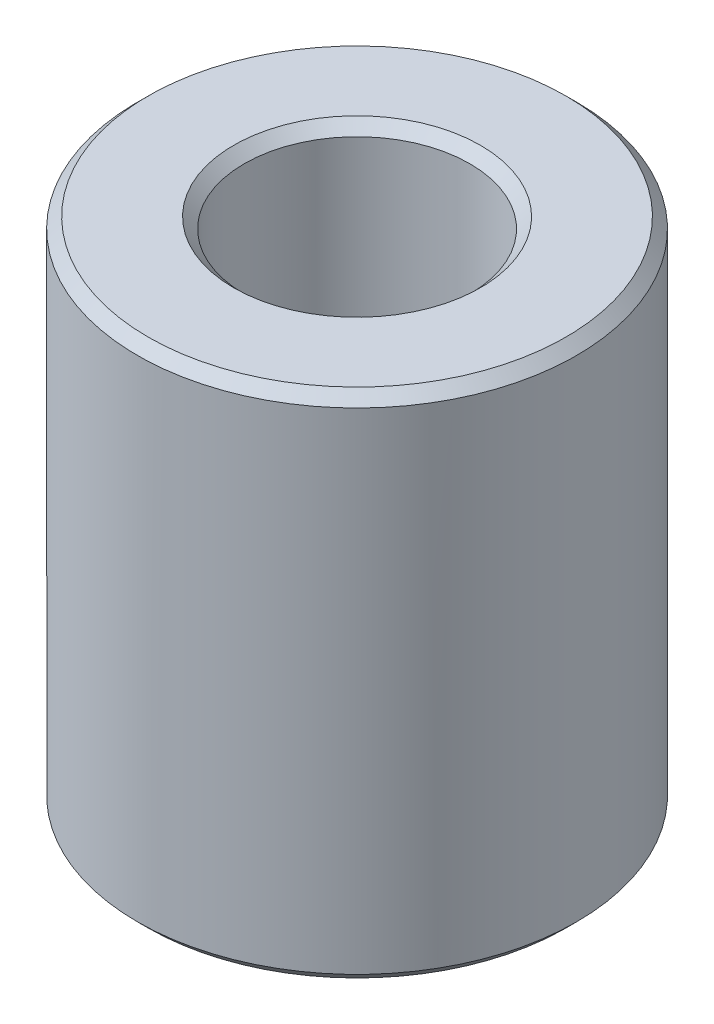
ISO-10303-21;
HEADER;
FILE_DESCRIPTION(('STEP AP214'),'2;1');
FILE_NAME('part.step','',(''),(''),'','','');
FILE_SCHEMA(('AUTOMOTIVE_DESIGN { 1 0 10303 214 1 1 1 1 }'));
ENDSEC;
DATA;
#1=APPLICATION_CONTEXT('core data for automotive mechanical design processes');
#2=APPLICATION_PROTOCOL_DEFINITION('international standard','automotive_design',2000,#1);
#3=PRODUCT_CONTEXT('',#1,'mechanical');
#4=PRODUCT('Part','Part','',(#3));
#5=PRODUCT_RELATED_PRODUCT_CATEGORY('part','',(#4));
#6=PRODUCT_DEFINITION_FORMATION('','',#4);
#7=PRODUCT_DEFINITION_CONTEXT('part definition',#1,'design');
#8=PRODUCT_DEFINITION('design','',#6,#7);
#9=PRODUCT_DEFINITION_SHAPE('','',#8);
#10=(LENGTH_UNIT() NAMED_UNIT(*) SI_UNIT(.MILLI.,.METRE.));
#11=(NAMED_UNIT(*) PLANE_ANGLE_UNIT() SI_UNIT($,.RADIAN.));
#12=(NAMED_UNIT(*) SI_UNIT($,.STERADIAN.) SOLID_ANGLE_UNIT());
#13=UNCERTAINTY_MEASURE_WITH_UNIT(LENGTH_MEASURE(1.E-05),#10,'distance_accuracy_value','');
#14=(GEOMETRIC_REPRESENTATION_CONTEXT(3) GLOBAL_UNCERTAINTY_ASSIGNED_CONTEXT((#13)) GLOBAL_UNIT_ASSIGNED_CONTEXT((#10,
#11,#12)) REPRESENTATION_CONTEXT('',''));
#15=CARTESIAN_POINT('',(0.,0.,0.));
#16=DIRECTION('',(0.,0.,1.));
#17=DIRECTION('',(1.,0.,0.));
#18=AXIS2_PLACEMENT_3D('',#15,#16,#17);
#19=CARTESIAN_POINT('',(0.,110.738072170009,0.));
#20=DIRECTION('',(0.,-1.,0.));
#21=DIRECTION('',(0.,0.,-1.));
#22=AXIS2_PLACEMENT_3D('',#19,#20,#21);
#23=CYLINDRICAL_SURFACE('',#22,47.5);
#24=CARTESIAN_POINT('',(0.,2.30081490421495,0.));
#25=DIRECTION('',(0.,1.,0.));
#26=DIRECTION('',(0.,0.,1.));
#27=AXIS2_PLACEMENT_3D('',#24,#25,#26);
#28=CIRCLE('',#27,47.5);
#29=CARTESIAN_POINT('',(0.,2.30081490421494,-47.5));
#30=VERTEX_POINT('',#29);
#31=EDGE_CURVE('E10',#30,#30,#28,.T.);
#32=CARTESIAN_POINT('',(0.,108.437257265794,0.));
#33=DIRECTION('',(0.,1.,0.));
#34=DIRECTION('',(0.,0.,1.));
#35=AXIS2_PLACEMENT_3D('',#32,#33,#34);
#36=CIRCLE('',#35,47.5);
#37=CARTESIAN_POINT('',(0.,108.437257265794,-47.5));
#38=VERTEX_POINT('',#37);
#39=EDGE_CURVE('E50',#38,#38,#36,.F.);
#40=CARTESIAN_POINT('',(0.,2.30081490421494,-47.5));
#41=CARTESIAN_POINT('',(0.,3.40640284548139,-47.5));
#42=CARTESIAN_POINT('',(0.,4.51199078674784,-47.5));
#43=CARTESIAN_POINT('',(0.,6.72316666928073,-47.5));
#44=CARTESIAN_POINT('',(0.,7.82875461054719,-47.5));
#45=CARTESIAN_POINT('',(0.,10.0399304930801,-47.5));
#46=CARTESIAN_POINT('',(0.,11.1455184343465,-47.5));
#47=CARTESIAN_POINT('',(0.,13.3566943168794,-47.5));
#48=CARTESIAN_POINT('',(0.,14.4622822581459,-47.5));
#49=CARTESIAN_POINT('',(0.,16.6734581406788,-47.5));
#50=CARTESIAN_POINT('',(0.,17.7790460819452,-47.5));
#51=CARTESIAN_POINT('',(0.,19.9902219644781,-47.5));
#52=CARTESIAN_POINT('',(0.,21.0958099057446,-47.5));
#53=CARTESIAN_POINT('',(0.,23.3069857882775,-47.5));
#54=CARTESIAN_POINT('',(0.,24.4125737295439,-47.5));
#55=CARTESIAN_POINT('',(0.,26.6237496120768,-47.5));
#56=CARTESIAN_POINT('',(0.,27.7293375533433,-47.5));
#57=CARTESIAN_POINT('',(0.,29.9405134358762,-47.5));
#58=CARTESIAN_POINT('',(0.,31.0461013771426,-47.5));
#59=CARTESIAN_POINT('',(0.,33.2572772596755,-47.5));
#60=CARTESIAN_POINT('',(0.,34.362865200942,-47.5));
#61=CARTESIAN_POINT('',(0.,36.5740410834749,-47.5));
#62=CARTESIAN_POINT('',(0.,37.6796290247413,-47.5));
#63=CARTESIAN_POINT('',(0.,39.8908049072742,-47.5));
#64=CARTESIAN_POINT('',(0.,40.9963928485407,-47.5));
#65=CARTESIAN_POINT('',(0.,43.2075687310736,-47.5));
#66=CARTESIAN_POINT('',(0.,44.31315667234,-47.5));
#67=CARTESIAN_POINT('',(0.,46.5243325548729,-47.5));
#68=CARTESIAN_POINT('',(0.,47.6299204961394,-47.5));
#69=CARTESIAN_POINT('',(0.,49.8410963786723,-47.5));
#70=CARTESIAN_POINT('',(0.,50.9466843199387,-47.5));
#71=CARTESIAN_POINT('',(0.,53.1578602024716,-47.5));
#72=CARTESIAN_POINT('',(0.,54.2634481437381,-47.5));
#73=CARTESIAN_POINT('',(0.,56.474624026271,-47.5));
#74=CARTESIAN_POINT('',(0.,57.5802119675374,-47.5));
#75=CARTESIAN_POINT('',(0.,59.7913878500703,-47.5));
#76=CARTESIAN_POINT('',(0.,60.8969757913368,-47.5));
#77=CARTESIAN_POINT('',(0.,63.1081516738697,-47.5));
#78=CARTESIAN_POINT('',(0.,64.2137396151361,-47.5));
#79=CARTESIAN_POINT('',(0.,66.424915497669,-47.5));
#80=CARTESIAN_POINT('',(0.,67.5305034389355,-47.5));
#81=CARTESIAN_POINT('',(0.,69.7416793214684,-47.5));
#82=CARTESIAN_POINT('',(0.,70.8472672627348,-47.5));
#83=CARTESIAN_POINT('',(0.,73.0584431452677,-47.5));
#84=CARTESIAN_POINT('',(0.,74.1640310865342,-47.5));
#85=CARTESIAN_POINT('',(0.,76.3752069690671,-47.5));
#86=CARTESIAN_POINT('',(0.,77.4807949103335,-47.5));
#87=CARTESIAN_POINT('',(0.,79.6919707928664,-47.5));
#88=CARTESIAN_POINT('',(0.,80.7975587341329,-47.5));
#89=CARTESIAN_POINT('',(0.,83.0087346166658,-47.5));
#90=CARTESIAN_POINT('',(0.,84.1143225579322,-47.5));
#91=CARTESIAN_POINT('',(0.,86.3254984404651,-47.5));
#92=CARTESIAN_POINT('',(0.,87.4310863817316,-47.5));
#93=CARTESIAN_POINT('',(0.,89.6422622642645,-47.5));
#94=CARTESIAN_POINT('',(0.,90.7478502055309,-47.5));
#95=CARTESIAN_POINT('',(0.,92.9590260880638,-47.5));
#96=CARTESIAN_POINT('',(0.,94.0646140293303,-47.5));
#97=CARTESIAN_POINT('',(0.,96.2757899118632,-47.5));
#98=CARTESIAN_POINT('',(0.,97.3813778531296,-47.5));
#99=CARTESIAN_POINT('',(0.,99.5925537356625,-47.5));
#100=CARTESIAN_POINT('',(0.,100.698141676929,-47.5));
#101=CARTESIAN_POINT('',(0.,102.909317559462,-47.5));
#102=CARTESIAN_POINT('',(0.,104.014905500728,-47.5));
#103=CARTESIAN_POINT('',(0.,106.226081383261,-47.5));
#104=CARTESIAN_POINT('',(0.,107.331669324528,-47.5));
#105=CARTESIAN_POINT('',(0.,108.437257265794,-47.5));
#106=B_SPLINE_CURVE_WITH_KNOTS('',3,(#40,#41,#42,#43,#44,#45,#46,#47,#48,#49,#50,#51,#52,#53,
#54,#55,#56,#57,#58,#59,#60,#61,#62,#63,#64,#65,#66,#67,#68,#69,#70,#71,#72,#73,#74,#75,#76,#77,
#78,#79,#80,#81,#82,#83,#84,#85,#86,#87,#88,#89,#90,#91,#92,#93,#94,#95,#96,#97,#98,#99,#100,
#101,#102,#103,#104,#105),.UNSPECIFIED.,.F.,.F.,(4,2,2,2,2,2,2,2,2,2,2,2,2,2,2,2,2,2,2,2,2,2,2,
2,2,2,2,2,2,2,2,2,4),(0.,3.31676382379935,6.6335276475987,9.95029147139805,13.2670552951974,
16.5838191189968,19.9005829427961,23.2173467665955,26.5341105903948,29.8508744141942,
33.1676382379935,36.4844020617928,39.8011658855922,43.1179297093915,46.4346935331909,
49.7514573569903,53.0682211807896,56.3849850045889,59.7017488283883,63.0185126521876,
66.335276475987,69.6520402997864,72.9688041235857,76.2855679473851,79.6023317711844,
82.9190955949837,86.2358594187831,89.5526232425824,92.8693870663818,96.1861508901812,
99.5029147139805,102.81967853778,106.136442361579),.UNSPECIFIED.);
#107=EDGE_CURVE('BSEAM39',#30,#38,#106,.T.);
#108=ORIENTED_EDGE('',*,*,#31,.T.);
#109=ORIENTED_EDGE('',*,*,#39,.T.);
#110=ORIENTED_EDGE('',*,*,#107,.T.);
#111=ORIENTED_EDGE('',*,*,#107,.F.);
#112=EDGE_LOOP('',(#108,#110,#109,#111));
#113=FACE_BOUND('',#112,.T.);
#114=ADVANCED_FACE('F39',(#113),#23,.T.);
#115=CARTESIAN_POINT('',(0.,110.738072170009,0.));
#116=DIRECTION('',(0.,1.,0.));
#117=DIRECTION('',(0.,0.,1.));
#118=AXIS2_PLACEMENT_3D('',#115,#116,#117);
#119=PLANE('',#118);
#120=CARTESIAN_POINT('',(0.,110.738072170009,0.));
#121=DIRECTION('',(0.,1.,0.));
#122=DIRECTION('',(0.,0.,1.));
#123=AXIS2_PLACEMENT_3D('',#120,#121,#122);
#124=CIRCLE('',#123,26.7057221796815);
#125=CARTESIAN_POINT('',(0.,110.738072170009,26.7057221796815));
#126=VERTEX_POINT('',#125);
#127=EDGE_CURVE('E58',#126,#126,#124,.F.);
#128=ORIENTED_EDGE('',*,*,#127,.T.);
#129=EDGE_LOOP('',(#128));
#130=FACE_BOUND('',#129,.T.);
#131=CARTESIAN_POINT('',(0.,110.738072170009,0.));
#132=DIRECTION('',(0.,1.,0.));
#133=DIRECTION('',(0.,0.,1.));
#134=AXIS2_PLACEMENT_3D('',#131,#132,#133);
#135=CIRCLE('',#134,45.1991850957853);
#136=CARTESIAN_POINT('',(0.,110.738072170009,45.1991850957853));
#137=VERTEX_POINT('',#136);
#138=EDGE_CURVE('E61',#137,#137,#135,.T.);
#139=ORIENTED_EDGE('',*,*,#138,.T.);
#140=EDGE_LOOP('',(#139));
#141=FACE_BOUND('',#140,.T.);
#142=ADVANCED_FACE('F88',(#130,#141),#119,.T.);
#143=CARTESIAN_POINT('',(0.,0.,0.));
#144=DIRECTION('',(0.,1.,0.));
#145=DIRECTION('',(0.,0.,1.));
#146=AXIS2_PLACEMENT_3D('',#143,#144,#145);
#147=PLANE('',#146);
#148=CARTESIAN_POINT('',(0.,0.,0.));
#149=DIRECTION('',(0.,1.,0.));
#150=DIRECTION('',(0.,0.,1.));
#151=AXIS2_PLACEMENT_3D('',#148,#149,#150);
#152=CIRCLE('',#151,26.7057221796813);
#153=CARTESIAN_POINT('',(0.,0.,26.7057221796813));
#154=VERTEX_POINT('',#153);
#155=EDGE_CURVE('E51',#154,#154,#152,.T.);
#156=ORIENTED_EDGE('',*,*,#155,.T.);
#157=EDGE_LOOP('',(#156));
#158=FACE_BOUND('',#157,.T.);
#159=CARTESIAN_POINT('',(0.,0.,0.));
#160=DIRECTION('',(0.,1.,0.));
#161=DIRECTION('',(0.,0.,1.));
#162=AXIS2_PLACEMENT_3D('',#159,#160,#161);
#163=CIRCLE('',#162,45.199185095785);
#164=CARTESIAN_POINT('',(0.,0.,45.199185095785));
#165=VERTEX_POINT('',#164);
#166=EDGE_CURVE('E54',#165,#165,#163,.F.);
#167=ORIENTED_EDGE('',*,*,#166,.T.);
#168=EDGE_LOOP('',(#167));
#169=FACE_BOUND('',#168,.T.);
#170=ADVANCED_FACE('F83',(#158,#169),#147,.F.);
#171=CARTESIAN_POINT('',(0.,110.738072170009,0.));
#172=DIRECTION('',(0.,-1.,0.));
#173=DIRECTION('',(0.,0.,-1.));
#174=AXIS2_PLACEMENT_3D('',#171,#172,#173);
#175=CYLINDRICAL_SURFACE('',#174,24.4049072754665);
#176=CARTESIAN_POINT('',(0.,108.437257265794,0.));
#177=DIRECTION('',(0.,1.,0.));
#178=DIRECTION('',(0.,0.,1.));
#179=AXIS2_PLACEMENT_3D('',#176,#177,#178);
#180=CIRCLE('',#179,24.4049072754665);
#181=CARTESIAN_POINT('',(0.,108.437257265794,-24.4049072754665));
#182=VERTEX_POINT('',#181);
#183=EDGE_CURVE('E67',#182,#182,#180,.T.);
#184=CARTESIAN_POINT('',(0.,2.30081490421481,0.));
#185=DIRECTION('',(0.,1.,0.));
#186=DIRECTION('',(0.,0.,1.));
#187=AXIS2_PLACEMENT_3D('',#184,#185,#186);
#188=CIRCLE('',#187,24.4049072754665);
#189=CARTESIAN_POINT('',(0.,2.3008149042148,-24.4049072754665));
#190=VERTEX_POINT('',#189);
#191=EDGE_CURVE('E69',#190,#190,#188,.F.);
#192=CARTESIAN_POINT('',(0.,108.437257265794,-24.4049072754665));
#193=CARTESIAN_POINT('',(0.,107.331669324528,-24.4049072754665));
#194=CARTESIAN_POINT('',(0.,106.226081383261,-24.4049072754665));
#195=CARTESIAN_POINT('',(0.,104.014905500728,-24.4049072754665));
#196=CARTESIAN_POINT('',(0.,102.909317559462,-24.4049072754665));
#197=CARTESIAN_POINT('',(0.,100.698141676929,-24.4049072754665));
#198=CARTESIAN_POINT('',(0.,99.5925537356624,-24.4049072754665));
#199=CARTESIAN_POINT('',(0.,97.3813778531295,-24.4049072754665));
#200=CARTESIAN_POINT('',(0.,96.275789911863,-24.4049072754665));
#201=CARTESIAN_POINT('',(0.,94.0646140293301,-24.4049072754665));
#202=CARTESIAN_POINT('',(0.,92.9590260880637,-24.4049072754665));
#203=CARTESIAN_POINT('',(0.,90.7478502055308,-24.4049072754665));
#204=CARTESIAN_POINT('',(0.,89.6422622642643,-24.4049072754665));
#205=CARTESIAN_POINT('',(0.,87.4310863817314,-24.4049072754665));
#206=CARTESIAN_POINT('',(0.,86.325498440465,-24.4049072754665));
#207=CARTESIAN_POINT('',(0.,84.1143225579321,-24.4049072754665));
#208=CARTESIAN_POINT('',(0.,83.0087346166656,-24.4049072754665));
#209=CARTESIAN_POINT('',(0.,80.7975587341327,-24.4049072754665));
#210=CARTESIAN_POINT('',(0.,79.6919707928663,-24.4049072754665));
#211=CARTESIAN_POINT('',(0.,77.4807949103334,-24.4049072754665));
#212=CARTESIAN_POINT('',(0.,76.3752069690669,-24.4049072754665));
#213=CARTESIAN_POINT('',(0.,74.164031086534,-24.4049072754665));
#214=CARTESIAN_POINT('',(0.,73.0584431452676,-24.4049072754665));
#215=CARTESIAN_POINT('',(0.,70.8472672627347,-24.4049072754665));
#216=CARTESIAN_POINT('',(0.,69.7416793214682,-24.4049072754665));
#217=CARTESIAN_POINT('',(0.,67.5305034389353,-24.4049072754665));
#218=CARTESIAN_POINT('',(0.,66.4249154976689,-24.4049072754665));
#219=CARTESIAN_POINT('',(0.,64.213739615136,-24.4049072754665));
#220=CARTESIAN_POINT('',(0.,63.1081516738695,-24.4049072754665));
#221=CARTESIAN_POINT('',(0.,60.8969757913366,-24.4049072754665));
#222=CARTESIAN_POINT('',(0.,59.7913878500702,-24.4049072754665));
#223=CARTESIAN_POINT('',(0.,57.5802119675373,-24.4049072754665));
#224=CARTESIAN_POINT('',(0.,56.4746240262708,-24.4049072754665));
#225=CARTESIAN_POINT('',(0.,54.2634481437379,-24.4049072754665));
#226=CARTESIAN_POINT('',(0.,53.1578602024715,-24.4049072754665));
#227=CARTESIAN_POINT('',(0.,50.9466843199386,-24.4049072754665));
#228=CARTESIAN_POINT('',(0.,49.8410963786721,-24.4049072754665));
#229=CARTESIAN_POINT('',(0.,47.6299204961392,-24.4049072754665));
#230=CARTESIAN_POINT('',(0.,46.5243325548728,-24.4049072754665));
#231=CARTESIAN_POINT('',(0.,44.3131566723399,-24.4049072754665));
#232=CARTESIAN_POINT('',(0.,43.2075687310735,-24.4049072754665));
#233=CARTESIAN_POINT('',(0.,40.9963928485406,-24.4049072754665));
#234=CARTESIAN_POINT('',(0.,39.8908049072741,-24.4049072754665));
#235=CARTESIAN_POINT('',(0.,37.6796290247412,-24.4049072754665));
#236=CARTESIAN_POINT('',(0.,36.5740410834747,-24.4049072754665));
#237=CARTESIAN_POINT('',(0.,34.3628652009418,-24.4049072754665));
#238=CARTESIAN_POINT('',(0.,33.2572772596754,-24.4049072754665));
#239=CARTESIAN_POINT('',(0.,31.0461013771425,-24.4049072754665));
#240=CARTESIAN_POINT('',(0.,29.940513435876,-24.4049072754665));
#241=CARTESIAN_POINT('',(0.,27.7293375533431,-24.4049072754665));
#242=CARTESIAN_POINT('',(0.,26.6237496120767,-24.4049072754665));
#243=CARTESIAN_POINT('',(0.,24.4125737295438,-24.4049072754665));
#244=CARTESIAN_POINT('',(0.,23.3069857882773,-24.4049072754665));
#245=CARTESIAN_POINT('',(0.,21.0958099057444,-24.4049072754665));
#246=CARTESIAN_POINT('',(0.,19.990221964478,-24.4049072754665));
#247=CARTESIAN_POINT('',(0.,17.7790460819451,-24.4049072754665));
#248=CARTESIAN_POINT('',(0.,16.6734581406786,-24.4049072754665));
#249=CARTESIAN_POINT('',(0.,14.4622822581457,-24.4049072754665));
#250=CARTESIAN_POINT('',(0.,13.3566943168793,-24.4049072754665));
#251=CARTESIAN_POINT('',(0.,11.1455184343464,-24.4049072754665));
#252=CARTESIAN_POINT('',(0.,10.0399304930799,-24.4049072754665));
#253=CARTESIAN_POINT('',(0.,7.82875461054704,-24.4049072754665));
#254=CARTESIAN_POINT('',(0.,6.72316666928059,-24.4049072754665));
#255=CARTESIAN_POINT('',(0.,4.51199078674769,-24.4049072754665));
#256=CARTESIAN_POINT('',(0.,3.40640284548124,-24.4049072754665));
#257=CARTESIAN_POINT('',(0.,2.3008149042148,-24.4049072754665));
#258=B_SPLINE_CURVE_WITH_KNOTS('',3,(#192,#193,#194,#195,#196,#197,#198,#199,#200,#201,#202,
#203,#204,#205,#206,#207,#208,#209,#210,#211,#212,#213,#214,#215,#216,#217,#218,#219,#220,#221,
#222,#223,#224,#225,#226,#227,#228,#229,#230,#231,#232,#233,#234,#235,#236,#237,#238,#239,#240,
#241,#242,#243,#244,#245,#246,#247,#248,#249,#250,#251,#252,#253,#254,#255,#256,#257),
.UNSPECIFIED.,.F.,.F.,(4,2,2,2,2,2,2,2,2,2,2,2,2,2,2,2,2,2,2,2,2,2,2,2,2,2,2,2,2,2,2,2,4),(0.,
3.31676382379936,6.63352764759871,9.95029147139806,13.2670552951974,16.5838191189968,
19.9005829427961,23.2173467665955,26.5341105903948,29.8508744141942,33.1676382379935,
36.4844020617929,39.8011658855922,43.1179297093916,46.4346935331909,49.7514573569903,
53.0682211807896,56.384985004589,59.7017488283883,63.0185126521877,66.335276475987,
69.6520402997863,72.9688041235857,76.285567947385,79.6023317711844,82.9190955949837,
86.2358594187831,89.5526232425824,92.8693870663818,96.1861508901812,99.5029147139805,
102.81967853778,106.136442361579),.UNSPECIFIED.);
#259=EDGE_CURVE('BSEAM71',#182,#190,#258,.T.);
#260=ORIENTED_EDGE('',*,*,#183,.T.);
#261=ORIENTED_EDGE('',*,*,#191,.T.);
#262=ORIENTED_EDGE('',*,*,#259,.T.);
#263=ORIENTED_EDGE('',*,*,#259,.F.);
#264=EDGE_LOOP('',(#260,#262,#261,#263));
#265=FACE_BOUND('',#264,.T.);
#266=ADVANCED_FACE('F71',(#265),#175,.F.);
#267=CARTESIAN_POINT('',(0.,108.437257265794,0.));
#268=DIRECTION('',(0.,1.,0.));
#269=DIRECTION('',(0.,0.,1.));
#270=AXIS2_PLACEMENT_3D('',#267,#268,#269);
#271=CONICAL_SURFACE('',#270,24.4049072754665,0.785398163397451);
#272=ORIENTED_EDGE('',*,*,#127,.F.);
#273=EDGE_LOOP('',(#272));
#274=FACE_BOUND('',#273,.T.);
#275=ORIENTED_EDGE('',*,*,#183,.F.);
#276=EDGE_LOOP('',(#275));
#277=FACE_BOUND('',#276,.T.);
#278=ADVANCED_FACE('F77',(#274,#277),#271,.F.);
#279=CARTESIAN_POINT('',(0.,0.,0.));
#280=DIRECTION('',(0.,-1.,0.));
#281=DIRECTION('',(0.,0.,-1.));
#282=AXIS2_PLACEMENT_3D('',#279,#280,#281);
#283=CONICAL_SURFACE('',#282,26.7057221796813,0.785398163397445);
#284=ORIENTED_EDGE('',*,*,#191,.F.);
#285=EDGE_LOOP('',(#284));
#286=FACE_BOUND('',#285,.T.);
#287=ORIENTED_EDGE('',*,*,#155,.F.);
#288=EDGE_LOOP('',(#287));
#289=FACE_BOUND('',#288,.T.);
#290=ADVANCED_FACE('F73',(#286,#289),#283,.F.);
#291=CARTESIAN_POINT('',(0.,2.30081490421495,0.));
#292=DIRECTION('',(0.,1.,0.));
#293=DIRECTION('',(0.,0.,1.));
#294=AXIS2_PLACEMENT_3D('',#291,#292,#293);
#295=CONICAL_SURFACE('',#294,47.5,0.785398163397453);
#296=ORIENTED_EDGE('',*,*,#166,.F.);
#297=EDGE_LOOP('',(#296));
#298=FACE_BOUND('',#297,.T.);
#299=ORIENTED_EDGE('',*,*,#31,.F.);
#300=EDGE_LOOP('',(#299));
#301=FACE_BOUND('',#300,.T.);
#302=ADVANCED_FACE('F76',(#298,#301),#295,.T.);
#303=CARTESIAN_POINT('',(0.,110.738072170009,0.));
#304=DIRECTION('',(0.,-1.,0.));
#305=DIRECTION('',(0.,0.,-1.));
#306=AXIS2_PLACEMENT_3D('',#303,#304,#305);
#307=CONICAL_SURFACE('',#306,45.1991850957853,0.785398163397439);
#308=ORIENTED_EDGE('',*,*,#39,.F.);
#309=EDGE_LOOP('',(#308));
#310=FACE_BOUND('',#309,.T.);
#311=ORIENTED_EDGE('',*,*,#138,.F.);
#312=EDGE_LOOP('',(#311));
#313=FACE_BOUND('',#312,.T.);
#314=ADVANCED_FACE('F45',(#310,#313),#307,.T.);
#315=CLOSED_SHELL('',(#114,#142,#170,#266,#278,#290,#302,#314));
#316=MANIFOLD_SOLID_BREP('B2',#315);
#317=ADVANCED_BREP_SHAPE_REPRESENTATION('',(#18,#316),#14);
#318=SHAPE_DEFINITION_REPRESENTATION(#9,#317);
ENDSEC;
END-ISO-10303-21;
